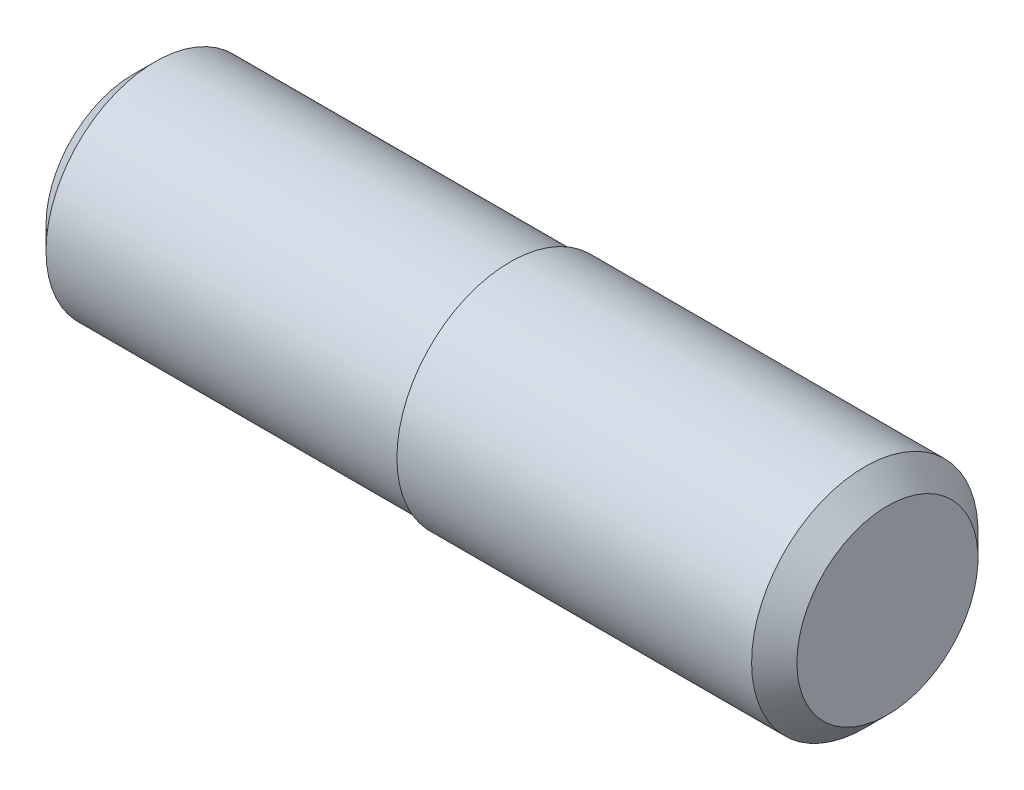
ISO-10303-21;
HEADER;
FILE_DESCRIPTION(('STEP AP214'),'2;1');
FILE_NAME('part.step','',(''),(''),'','','');
FILE_SCHEMA(('AUTOMOTIVE_DESIGN { 1 0 10303 214 1 1 1 1 }'));
ENDSEC;
DATA;
#1=APPLICATION_CONTEXT('core data for automotive mechanical design processes');
#2=APPLICATION_PROTOCOL_DEFINITION('international standard','automotive_design',2000,#1);
#3=PRODUCT_CONTEXT('',#1,'mechanical');
#4=PRODUCT('Part','Part','',(#3));
#5=PRODUCT_RELATED_PRODUCT_CATEGORY('part','',(#4));
#6=PRODUCT_DEFINITION_FORMATION('','',#4);
#7=PRODUCT_DEFINITION_CONTEXT('part definition',#1,'design');
#8=PRODUCT_DEFINITION('design','',#6,#7);
#9=PRODUCT_DEFINITION_SHAPE('','',#8);
#10=(LENGTH_UNIT() NAMED_UNIT(*) SI_UNIT(.MILLI.,.METRE.));
#11=(NAMED_UNIT(*) PLANE_ANGLE_UNIT() SI_UNIT($,.RADIAN.));
#12=(NAMED_UNIT(*) SI_UNIT($,.STERADIAN.) SOLID_ANGLE_UNIT());
#13=UNCERTAINTY_MEASURE_WITH_UNIT(LENGTH_MEASURE(1.E-05),#10,'distance_accuracy_value','');
#14=(GEOMETRIC_REPRESENTATION_CONTEXT(3) GLOBAL_UNCERTAINTY_ASSIGNED_CONTEXT((#13)) GLOBAL_UNIT_ASSIGNED_CONTEXT((#10,
#11,#12)) REPRESENTATION_CONTEXT('',''));
#15=CARTESIAN_POINT('',(0.,0.,0.));
#16=DIRECTION('',(0.,0.,1.));
#17=DIRECTION('',(1.,0.,0.));
#18=AXIS2_PLACEMENT_3D('',#15,#16,#17);
#19=CARTESIAN_POINT('',(-6.79253012048193,0.,0.));
#20=DIRECTION('',(1.,0.,0.));
#21=DIRECTION('',(0.,0.,-1.));
#22=AXIS2_PLACEMENT_3D('',#19,#20,#21);
#23=PLANE('',#22);
#24=CARTESIAN_POINT('',(-6.79253012048193,0.,0.));
#25=DIRECTION('',(1.,0.,0.));
#26=DIRECTION('',(0.,0.,-1.));
#27=AXIS2_PLACEMENT_3D('',#24,#25,#26);
#28=CIRCLE('',#27,1.15);
#29=CARTESIAN_POINT('',(-6.79253012048193,0.,-1.15));
#30=VERTEX_POINT('',#29);
#31=EDGE_CURVE('E43',#30,#30,#28,.F.);
#32=ORIENTED_EDGE('',*,*,#31,.T.);
#33=EDGE_LOOP('',(#32));
#34=FACE_BOUND('',#33,.T.);
#35=ADVANCED_FACE('F36',(#34),#23,.F.);
#36=CARTESIAN_POINT('',(-2.50867469879518,0.,0.));
#37=DIRECTION('',(-1.,0.,0.));
#38=DIRECTION('',(0.,0.,1.));
#39=AXIS2_PLACEMENT_3D('',#36,#37,#38);
#40=CYLINDRICAL_SURFACE('',#39,1.45);
#41=CARTESIAN_POINT('',(-6.49253012048193,0.,0.));
#42=DIRECTION('',(1.,0.,0.));
#43=DIRECTION('',(0.,0.,-1.));
#44=AXIS2_PLACEMENT_3D('',#41,#42,#43);
#45=CIRCLE('',#44,1.45);
#46=CARTESIAN_POINT('',(-6.49253012048193,0.,-1.45));
#47=VERTEX_POINT('',#46);
#48=EDGE_CURVE('E10',#47,#47,#45,.T.);
#49=ORIENTED_EDGE('',*,*,#48,.T.);
#50=EDGE_LOOP('',(#49));
#51=FACE_BOUND('',#50,.T.);
#52=CARTESIAN_POINT('',(-1.79253012048193,0.,0.));
#53=DIRECTION('',(-1.,0.,0.));
#54=DIRECTION('',(0.,0.,1.));
#55=AXIS2_PLACEMENT_3D('',#52,#53,#54);
#56=CIRCLE('',#55,1.45);
#57=CARTESIAN_POINT('',(-1.79253012048193,0.,1.45));
#58=VERTEX_POINT('',#57);
#59=EDGE_CURVE('E56',#58,#58,#56,.T.);
#60=ORIENTED_EDGE('',*,*,#59,.T.);
#61=EDGE_LOOP('',(#60));
#62=FACE_BOUND('',#61,.T.);
#63=ADVANCED_FACE('F77',(#51,#62),#40,.T.);
#64=CARTESIAN_POINT('',(-1.79253012048193,1.45,0.));
#65=DIRECTION('',(1.,0.,0.));
#66=DIRECTION('',(0.,0.,-1.));
#67=AXIS2_PLACEMENT_3D('',#64,#65,#66);
#68=PLANE('',#67);
#69=ORIENTED_EDGE('',*,*,#59,.F.);
#70=EDGE_LOOP('',(#69));
#71=FACE_BOUND('',#70,.T.);
#72=CARTESIAN_POINT('',(-1.79253012048193,0.,0.));
#73=DIRECTION('',(-1.,0.,0.));
#74=DIRECTION('',(0.,0.,1.));
#75=AXIS2_PLACEMENT_3D('',#72,#73,#74);
#76=CIRCLE('',#75,1.5);
#77=CARTESIAN_POINT('',(-1.79253012048193,0.,1.5));
#78=VERTEX_POINT('',#77);
#79=EDGE_CURVE('E59',#78,#78,#76,.T.);
#80=ORIENTED_EDGE('',*,*,#79,.T.);
#81=EDGE_LOOP('',(#80));
#82=FACE_BOUND('',#81,.T.);
#83=ADVANCED_FACE('F63',(#71,#82),#68,.F.);
#84=CARTESIAN_POINT('',(-2.50867469879518,0.,0.));
#85=DIRECTION('',(-1.,0.,0.));
#86=DIRECTION('',(0.,0.,1.));
#87=AXIS2_PLACEMENT_3D('',#84,#85,#86);
#88=CYLINDRICAL_SURFACE('',#87,1.5);
#89=CARTESIAN_POINT('',(2.90746987951807,0.,0.));
#90=DIRECTION('',(-1.,0.,0.));
#91=DIRECTION('',(0.,0.,1.));
#92=AXIS2_PLACEMENT_3D('',#89,#90,#91);
#93=CIRCLE('',#92,1.5);
#94=CARTESIAN_POINT('',(2.90746987951807,0.,1.5));
#95=VERTEX_POINT('',#94);
#96=EDGE_CURVE('E51',#95,#95,#93,.T.);
#97=ORIENTED_EDGE('',*,*,#96,.T.);
#98=EDGE_LOOP('',(#97));
#99=FACE_BOUND('',#98,.T.);
#100=ORIENTED_EDGE('',*,*,#79,.F.);
#101=EDGE_LOOP('',(#100));
#102=FACE_BOUND('',#101,.T.);
#103=ADVANCED_FACE('F65',(#99,#102),#88,.T.);
#104=CARTESIAN_POINT('',(3.20746987951807,1.5,0.));
#105=DIRECTION('',(-1.,0.,0.));
#106=DIRECTION('',(0.,0.,1.));
#107=AXIS2_PLACEMENT_3D('',#104,#105,#106);
#108=PLANE('',#107);
#109=CARTESIAN_POINT('',(3.20746987951807,0.,0.));
#110=DIRECTION('',(-1.,0.,0.));
#111=DIRECTION('',(0.,0.,1.));
#112=AXIS2_PLACEMENT_3D('',#109,#110,#111);
#113=CIRCLE('',#112,1.2);
#114=CARTESIAN_POINT('',(3.20746987951807,0.,1.2));
#115=VERTEX_POINT('',#114);
#116=EDGE_CURVE('E47',#115,#115,#113,.F.);
#117=ORIENTED_EDGE('',*,*,#116,.T.);
#118=EDGE_LOOP('',(#117));
#119=FACE_BOUND('',#118,.T.);
#120=ADVANCED_FACE('F67',(#119),#108,.F.);
#121=CARTESIAN_POINT('',(2.90746987951807,0.,0.));
#122=DIRECTION('',(-1.,0.,0.));
#123=DIRECTION('',(0.,0.,1.));
#124=AXIS2_PLACEMENT_3D('',#121,#122,#123);
#125=CONICAL_SURFACE('',#124,1.5,0.78539816339745);
#126=ORIENTED_EDGE('',*,*,#116,.F.);
#127=EDGE_LOOP('',(#126));
#128=FACE_BOUND('',#127,.T.);
#129=ORIENTED_EDGE('',*,*,#96,.F.);
#130=EDGE_LOOP('',(#129));
#131=FACE_BOUND('',#130,.T.);
#132=ADVANCED_FACE('F74',(#128,#131),#125,.T.);
#133=CARTESIAN_POINT('',(-6.79253012048193,0.,0.));
#134=DIRECTION('',(1.,0.,0.));
#135=DIRECTION('',(0.,0.,-1.));
#136=AXIS2_PLACEMENT_3D('',#133,#134,#135);
#137=CONICAL_SURFACE('',#136,1.15,0.785398163397444);
#138=ORIENTED_EDGE('',*,*,#48,.F.);
#139=EDGE_LOOP('',(#138));
#140=FACE_BOUND('',#139,.T.);
#141=ORIENTED_EDGE('',*,*,#31,.F.);
#142=EDGE_LOOP('',(#141));
#143=FACE_BOUND('',#142,.T.);
#144=ADVANCED_FACE('F38',(#140,#143),#137,.T.);
#145=CLOSED_SHELL('',(#35,#63,#83,#103,#120,#132,#144));
#146=MANIFOLD_SOLID_BREP('B2',#145);
#147=ADVANCED_BREP_SHAPE_REPRESENTATION('',(#18,#146),#14);
#148=SHAPE_DEFINITION_REPRESENTATION(#9,#147);
ENDSEC;
END-ISO-10303-21;
